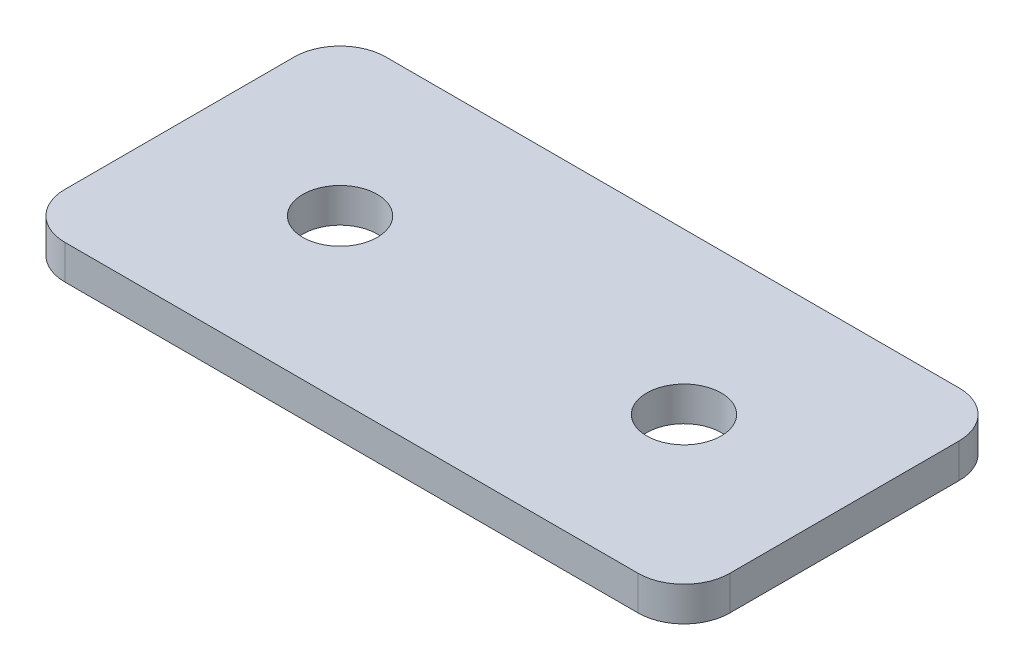
ISO-10303-21;
HEADER;
FILE_DESCRIPTION(('STEP AP214'),'2;1');
FILE_NAME('part.step','',(''),(''),'','','');
FILE_SCHEMA(('AUTOMOTIVE_DESIGN { 1 0 10303 214 1 1 1 1 }'));
ENDSEC;
DATA;
#1=APPLICATION_CONTEXT('core data for automotive mechanical design processes');
#2=APPLICATION_PROTOCOL_DEFINITION('international standard','automotive_design',2000,#1);
#3=PRODUCT_CONTEXT('',#1,'mechanical');
#4=PRODUCT('Part','Part','',(#3));
#5=PRODUCT_RELATED_PRODUCT_CATEGORY('part','',(#4));
#6=PRODUCT_DEFINITION_FORMATION('','',#4);
#7=PRODUCT_DEFINITION_CONTEXT('part definition',#1,'design');
#8=PRODUCT_DEFINITION('design','',#6,#7);
#9=PRODUCT_DEFINITION_SHAPE('','',#8);
#10=(LENGTH_UNIT() NAMED_UNIT(*) SI_UNIT(.MILLI.,.METRE.));
#11=(NAMED_UNIT(*) PLANE_ANGLE_UNIT() SI_UNIT($,.RADIAN.));
#12=(NAMED_UNIT(*) SI_UNIT($,.STERADIAN.) SOLID_ANGLE_UNIT());
#13=UNCERTAINTY_MEASURE_WITH_UNIT(LENGTH_MEASURE(1.E-05),#10,'distance_accuracy_value','');
#14=(GEOMETRIC_REPRESENTATION_CONTEXT(3) GLOBAL_UNCERTAINTY_ASSIGNED_CONTEXT((#13)) GLOBAL_UNIT_ASSIGNED_CONTEXT((#10,
#11,#12)) REPRESENTATION_CONTEXT('',''));
#15=CARTESIAN_POINT('',(0.,0.,0.));
#16=DIRECTION('',(0.,0.,1.));
#17=DIRECTION('',(1.,0.,0.));
#18=AXIS2_PLACEMENT_3D('',#15,#16,#17);
#19=CARTESIAN_POINT('',(-8.92451364331455,1.52470932668439,-0.849826009471142));
#20=DIRECTION('',(0.,-1.,0.));
#21=DIRECTION('',(0.,0.,-1.));
#22=AXIS2_PLACEMENT_3D('',#19,#20,#21);
#23=PLANE('',#22);
#24=CARTESIAN_POINT('',(6.07548635668547,1.52470932668439,-0.849826009471132));
#25=DIRECTION('',(0.,1.,0.));
#26=DIRECTION('',(0.,0.,1.));
#27=AXIS2_PLACEMENT_3D('',#24,#25,#26);
#28=CIRCLE('',#27,1.625);
#29=CARTESIAN_POINT('',(6.07548635668547,1.52470932668439,0.775173990528869));
#30=VERTEX_POINT('',#29);
#31=EDGE_CURVE('E157',#30,#30,#28,.T.);
#32=ORIENTED_EDGE('',*,*,#31,.T.);
#33=EDGE_LOOP('',(#32));
#34=FACE_BOUND('',#33,.T.);
#35=CARTESIAN_POINT('',(-8.92451364331455,1.52470932668439,-0.849826009471142));
#36=DIRECTION('',(0.,1.,0.));
#37=DIRECTION('',(0.,0.,1.));
#38=AXIS2_PLACEMENT_3D('',#35,#36,#37);
#39=CIRCLE('',#38,1.625);
#40=CARTESIAN_POINT('',(-8.92451364331455,1.52470932668439,0.775173990528858));
#41=VERTEX_POINT('',#40);
#42=EDGE_CURVE('E103',#41,#41,#39,.T.);
#43=ORIENTED_EDGE('',*,*,#42,.T.);
#44=EDGE_LOOP('',(#43));
#45=FACE_BOUND('',#44,.T.);
#46=DIRECTION('',(0.,0.,-1.));
#47=VECTOR('',#46,1.);
#48=CARTESIAN_POINT('',(13.0754863566854,1.52470932668439,6.1501739905289));
#49=LINE('',#48,#47);
#50=CARTESIAN_POINT('',(13.0754863566854,1.52470932668439,4.1501739905289));
#51=VERTEX_POINT('',#50);
#52=CARTESIAN_POINT('',(13.0754863566854,1.52470932668439,-5.84982600947118));
#53=VERTEX_POINT('',#52);
#54=EDGE_CURVE('E150',#51,#53,#49,.T.);
#55=ORIENTED_EDGE('',*,*,#54,.F.);
#56=CARTESIAN_POINT('',(11.0754863566854,1.52470932668439,4.1501739905289));
#57=DIRECTION('',(0.,-1.,0.));
#58=DIRECTION('',(0.,0.,-1.));
#59=AXIS2_PLACEMENT_3D('',#56,#57,#58);
#60=CIRCLE('',#59,2.);
#61=CARTESIAN_POINT('',(11.0754863566854,1.52470932668439,6.1501739905289));
#62=VERTEX_POINT('',#61);
#63=EDGE_CURVE('E130',#51,#62,#60,.T.);
#64=ORIENTED_EDGE('',*,*,#63,.T.);
#65=DIRECTION('',(1.,0.,0.));
#66=VECTOR('',#65,1.);
#67=CARTESIAN_POINT('',(-1.92451364331445,1.52470932668439,6.15017399052889));
#68=LINE('',#67,#66);
#69=CARTESIAN_POINT('',(-13.9245136433146,1.52470932668439,6.15017399052889));
#70=VERTEX_POINT('',#69);
#71=EDGE_CURVE('E146',#70,#62,#68,.T.);
#72=ORIENTED_EDGE('',*,*,#71,.F.);
#73=CARTESIAN_POINT('',(-13.9245136433146,1.52470932668439,4.15017399052889));
#74=DIRECTION('',(0.,-1.,0.));
#75=DIRECTION('',(0.,0.,-1.));
#76=AXIS2_PLACEMENT_3D('',#73,#74,#75);
#77=CIRCLE('',#76,2.);
#78=CARTESIAN_POINT('',(-15.9245136433146,1.52470932668439,4.15017399052889));
#79=VERTEX_POINT('',#78);
#80=EDGE_CURVE('E106',#70,#79,#77,.T.);
#81=ORIENTED_EDGE('',*,*,#80,.T.);
#82=DIRECTION('',(0.,0.,1.));
#83=VECTOR('',#82,1.);
#84=CARTESIAN_POINT('',(-15.9245136433146,1.52470932668439,-7.84982600947118));
#85=LINE('',#84,#83);
#86=CARTESIAN_POINT('',(-15.9245136433146,1.52470932668439,-5.84982600947118));
#87=VERTEX_POINT('',#86);
#88=EDGE_CURVE('E107',#87,#79,#85,.T.);
#89=ORIENTED_EDGE('',*,*,#88,.F.);
#90=CARTESIAN_POINT('',(-13.9245136433146,1.52470932668439,-5.84982600947118));
#91=DIRECTION('',(0.,-1.,0.));
#92=DIRECTION('',(0.,0.,-1.));
#93=AXIS2_PLACEMENT_3D('',#90,#91,#92);
#94=CIRCLE('',#93,2.);
#95=CARTESIAN_POINT('',(-13.9245136433146,1.52470932668439,-7.84982600947118));
#96=VERTEX_POINT('',#95);
#97=EDGE_CURVE('E31',#87,#96,#94,.T.);
#98=ORIENTED_EDGE('',*,*,#97,.T.);
#99=DIRECTION('',(-1.,0.,0.));
#100=VECTOR('',#99,1.);
#101=CARTESIAN_POINT('',(13.0754863566854,1.52470932668439,-7.84982600947118));
#102=LINE('',#101,#100);
#103=CARTESIAN_POINT('',(11.0754863566854,1.52470932668439,-7.84982600947118));
#104=VERTEX_POINT('',#103);
#105=EDGE_CURVE('E111',#104,#96,#102,.T.);
#106=ORIENTED_EDGE('',*,*,#105,.F.);
#107=CARTESIAN_POINT('',(11.0754863566854,1.52470932668439,-5.84982600947118));
#108=DIRECTION('',(0.,-1.,0.));
#109=DIRECTION('',(0.,0.,-1.));
#110=AXIS2_PLACEMENT_3D('',#107,#108,#109);
#111=CIRCLE('',#110,2.);
#112=EDGE_CURVE('E128',#104,#53,#111,.T.);
#113=ORIENTED_EDGE('',*,*,#112,.T.);
#114=EDGE_LOOP('',(#55,#64,#72,#81,#89,#98,#106,#113));
#115=FACE_BOUND('',#114,.T.);
#116=ADVANCED_FACE('F16',(#34,#45,#115),#23,.T.);
#117=CARTESIAN_POINT('',(-1.92451364331445,1.52470932668439,6.15017399052889));
#118=DIRECTION('',(0.,0.,1.));
#119=DIRECTION('',(1.,0.,0.));
#120=AXIS2_PLACEMENT_3D('',#117,#118,#119);
#121=PLANE('',#120);
#122=ORIENTED_EDGE('',*,*,#71,.T.);
#123=DIRECTION('',(0.,1.,0.));
#124=VECTOR('',#123,1.);
#125=CARTESIAN_POINT('',(11.0754863566854,1.52470932668439,6.1501739905289));
#126=LINE('',#125,#124);
#127=CARTESIAN_POINT('',(11.0754863566854,3.02470932668439,6.1501739905289));
#128=VERTEX_POINT('',#127);
#129=EDGE_CURVE('E93',#62,#128,#126,.T.);
#130=ORIENTED_EDGE('',*,*,#129,.T.);
#131=DIRECTION('',(1.,0.,0.));
#132=VECTOR('',#131,1.);
#133=CARTESIAN_POINT('',(-1.92451364331445,3.02470932668439,6.15017399052889));
#134=LINE('',#133,#132);
#135=CARTESIAN_POINT('',(-13.9245136433146,3.02470932668439,6.15017399052889));
#136=VERTEX_POINT('',#135);
#137=EDGE_CURVE('E85',#136,#128,#134,.T.);
#138=ORIENTED_EDGE('',*,*,#137,.F.);
#139=DIRECTION('',(0.,1.,0.));
#140=VECTOR('',#139,1.);
#141=CARTESIAN_POINT('',(-13.9245136433146,1.52470932668439,6.15017399052889));
#142=LINE('',#141,#140);
#143=EDGE_CURVE('E99',#136,#70,#142,.F.);
#144=ORIENTED_EDGE('',*,*,#143,.T.);
#145=EDGE_LOOP('',(#122,#130,#138,#144));
#146=FACE_BOUND('',#145,.T.);
#147=ADVANCED_FACE('F98',(#146),#121,.T.);
#148=CARTESIAN_POINT('',(-15.9245136433146,1.52470932668439,-7.84982600947118));
#149=DIRECTION('',(-1.,0.,0.));
#150=DIRECTION('',(0.,0.,1.));
#151=AXIS2_PLACEMENT_3D('',#148,#149,#150);
#152=PLANE('',#151);
#153=DIRECTION('',(0.,0.,1.));
#154=VECTOR('',#153,1.);
#155=CARTESIAN_POINT('',(-15.9245136433146,3.02470932668439,-7.84982600947118));
#156=LINE('',#155,#154);
#157=CARTESIAN_POINT('',(-15.9245136433146,3.02470932668439,-5.84982600947118));
#158=VERTEX_POINT('',#157);
#159=CARTESIAN_POINT('',(-15.9245136433146,3.02470932668439,4.15017399052889));
#160=VERTEX_POINT('',#159);
#161=EDGE_CURVE('E87',#158,#160,#156,.T.);
#162=ORIENTED_EDGE('',*,*,#161,.F.);
#163=DIRECTION('',(0.,1.,0.));
#164=VECTOR('',#163,1.);
#165=CARTESIAN_POINT('',(-15.9245136433146,1.52470932668439,-5.84982600947118));
#166=LINE('',#165,#164);
#167=EDGE_CURVE('E10',#158,#87,#166,.F.);
#168=ORIENTED_EDGE('',*,*,#167,.T.);
#169=ORIENTED_EDGE('',*,*,#88,.T.);
#170=DIRECTION('',(0.,1.,0.));
#171=VECTOR('',#170,1.);
#172=CARTESIAN_POINT('',(-15.9245136433146,1.52470932668439,4.15017399052889));
#173=LINE('',#172,#171);
#174=EDGE_CURVE('E24',#79,#160,#173,.T.);
#175=ORIENTED_EDGE('',*,*,#174,.T.);
#176=EDGE_LOOP('',(#162,#168,#169,#175));
#177=FACE_BOUND('',#176,.T.);
#178=ADVANCED_FACE('F136',(#177),#152,.T.);
#179=CARTESIAN_POINT('',(13.0754863566854,1.52470932668439,-7.84982600947118));
#180=DIRECTION('',(0.,0.,-1.));
#181=DIRECTION('',(-1.,0.,0.));
#182=AXIS2_PLACEMENT_3D('',#179,#180,#181);
#183=PLANE('',#182);
#184=DIRECTION('',(-1.,0.,0.));
#185=VECTOR('',#184,1.);
#186=CARTESIAN_POINT('',(13.0754863566854,3.02470932668439,-7.84982600947118));
#187=LINE('',#186,#185);
#188=CARTESIAN_POINT('',(11.0754863566854,3.02470932668439,-7.84982600947118));
#189=VERTEX_POINT('',#188);
#190=CARTESIAN_POINT('',(-13.9245136433146,3.02470932668439,-7.84982600947118));
#191=VERTEX_POINT('',#190);
#192=EDGE_CURVE('E144',#189,#191,#187,.T.);
#193=ORIENTED_EDGE('',*,*,#192,.F.);
#194=DIRECTION('',(0.,1.,0.));
#195=VECTOR('',#194,1.);
#196=CARTESIAN_POINT('',(11.0754863566854,1.52470932668439,-7.84982600947118));
#197=LINE('',#196,#195);
#198=EDGE_CURVE('E38',#189,#104,#197,.F.);
#199=ORIENTED_EDGE('',*,*,#198,.T.);
#200=ORIENTED_EDGE('',*,*,#105,.T.);
#201=DIRECTION('',(0.,1.,0.));
#202=VECTOR('',#201,1.);
#203=CARTESIAN_POINT('',(-13.9245136433146,1.52470932668439,-7.84982600947118));
#204=LINE('',#203,#202);
#205=EDGE_CURVE('E132',#96,#191,#204,.T.);
#206=ORIENTED_EDGE('',*,*,#205,.T.);
#207=EDGE_LOOP('',(#193,#199,#200,#206));
#208=FACE_BOUND('',#207,.T.);
#209=ADVANCED_FACE('F143',(#208),#183,.T.);
#210=CARTESIAN_POINT('',(13.0754863566854,1.52470932668439,6.1501739905289));
#211=DIRECTION('',(1.,0.,0.));
#212=DIRECTION('',(0.,0.,-1.));
#213=AXIS2_PLACEMENT_3D('',#210,#211,#212);
#214=PLANE('',#213);
#215=DIRECTION('',(0.,0.,-1.));
#216=VECTOR('',#215,1.);
#217=CARTESIAN_POINT('',(13.0754863566854,3.02470932668439,6.1501739905289));
#218=LINE('',#217,#216);
#219=CARTESIAN_POINT('',(13.0754863566854,3.02470932668439,4.1501739905289));
#220=VERTEX_POINT('',#219);
#221=CARTESIAN_POINT('',(13.0754863566854,3.02470932668439,-5.84982600947118));
#222=VERTEX_POINT('',#221);
#223=EDGE_CURVE('E102',#220,#222,#218,.T.);
#224=ORIENTED_EDGE('',*,*,#223,.F.);
#225=DIRECTION('',(0.,1.,0.));
#226=VECTOR('',#225,1.);
#227=CARTESIAN_POINT('',(13.0754863566854,1.52470932668439,4.1501739905289));
#228=LINE('',#227,#226);
#229=EDGE_CURVE('E124',#220,#51,#228,.F.);
#230=ORIENTED_EDGE('',*,*,#229,.T.);
#231=ORIENTED_EDGE('',*,*,#54,.T.);
#232=DIRECTION('',(0.,1.,0.));
#233=VECTOR('',#232,1.);
#234=CARTESIAN_POINT('',(13.0754863566854,1.52470932668439,-5.84982600947118));
#235=LINE('',#234,#233);
#236=EDGE_CURVE('E121',#53,#222,#235,.T.);
#237=ORIENTED_EDGE('',*,*,#236,.T.);
#238=EDGE_LOOP('',(#224,#230,#231,#237));
#239=FACE_BOUND('',#238,.T.);
#240=ADVANCED_FACE('F178',(#239),#214,.T.);
#241=CARTESIAN_POINT('',(-8.92451364331455,3.02470932668439,-0.849826009471142));
#242=DIRECTION('',(0.,-1.,0.));
#243=DIRECTION('',(0.,0.,-1.));
#244=AXIS2_PLACEMENT_3D('',#241,#242,#243);
#245=PLANE('',#244);
#246=CARTESIAN_POINT('',(6.07548635668547,3.02470932668439,-0.849826009471132));
#247=DIRECTION('',(0.,1.,0.));
#248=DIRECTION('',(0.,0.,1.));
#249=AXIS2_PLACEMENT_3D('',#246,#247,#248);
#250=CIRCLE('',#249,1.625);
#251=CARTESIAN_POINT('',(6.07548635668547,3.02470932668439,0.775173990528869));
#252=VERTEX_POINT('',#251);
#253=EDGE_CURVE('E160',#252,#252,#250,.T.);
#254=ORIENTED_EDGE('',*,*,#253,.F.);
#255=EDGE_LOOP('',(#254));
#256=FACE_BOUND('',#255,.T.);
#257=CARTESIAN_POINT('',(-8.92451364331455,3.02470932668439,-0.849826009471142));
#258=DIRECTION('',(0.,1.,0.));
#259=DIRECTION('',(0.,0.,1.));
#260=AXIS2_PLACEMENT_3D('',#257,#258,#259);
#261=CIRCLE('',#260,1.625);
#262=CARTESIAN_POINT('',(-8.92451364331455,3.02470932668439,0.775173990528858));
#263=VERTEX_POINT('',#262);
#264=EDGE_CURVE('E154',#263,#263,#261,.T.);
#265=ORIENTED_EDGE('',*,*,#264,.F.);
#266=EDGE_LOOP('',(#265));
#267=FACE_BOUND('',#266,.T.);
#268=ORIENTED_EDGE('',*,*,#137,.T.);
#269=CARTESIAN_POINT('',(11.0754863566854,3.02470932668439,4.1501739905289));
#270=DIRECTION('',(0.,-1.,0.));
#271=DIRECTION('',(0.,0.,-1.));
#272=AXIS2_PLACEMENT_3D('',#269,#270,#271);
#273=CIRCLE('',#272,2.);
#274=EDGE_CURVE('E119',#128,#220,#273,.F.);
#275=ORIENTED_EDGE('',*,*,#274,.T.);
#276=ORIENTED_EDGE('',*,*,#223,.T.);
#277=CARTESIAN_POINT('',(11.0754863566854,3.02470932668439,-5.84982600947118));
#278=DIRECTION('',(0.,-1.,0.));
#279=DIRECTION('',(0.,0.,-1.));
#280=AXIS2_PLACEMENT_3D('',#277,#278,#279);
#281=CIRCLE('',#280,2.);
#282=EDGE_CURVE('E117',#222,#189,#281,.F.);
#283=ORIENTED_EDGE('',*,*,#282,.T.);
#284=ORIENTED_EDGE('',*,*,#192,.T.);
#285=CARTESIAN_POINT('',(-13.9245136433146,3.02470932668439,-5.84982600947118));
#286=DIRECTION('',(0.,-1.,0.));
#287=DIRECTION('',(0.,0.,-1.));
#288=AXIS2_PLACEMENT_3D('',#285,#286,#287);
#289=CIRCLE('',#288,2.);
#290=EDGE_CURVE('E92',#191,#158,#289,.F.);
#291=ORIENTED_EDGE('',*,*,#290,.T.);
#292=ORIENTED_EDGE('',*,*,#161,.T.);
#293=CARTESIAN_POINT('',(-13.9245136433146,3.02470932668439,4.15017399052889));
#294=DIRECTION('',(0.,-1.,0.));
#295=DIRECTION('',(0.,0.,-1.));
#296=AXIS2_PLACEMENT_3D('',#293,#294,#295);
#297=CIRCLE('',#296,2.);
#298=EDGE_CURVE('E82',#160,#136,#297,.F.);
#299=ORIENTED_EDGE('',*,*,#298,.T.);
#300=EDGE_LOOP('',(#268,#275,#276,#283,#284,#291,#292,#299));
#301=FACE_BOUND('',#300,.T.);
#302=ADVANCED_FACE('F84',(#256,#267,#301),#245,.F.);
#303=CARTESIAN_POINT('',(-8.92451364331455,1.52470932668439,-0.849826009471142));
#304=DIRECTION('',(0.,1.,0.));
#305=DIRECTION('',(0.,0.,1.));
#306=AXIS2_PLACEMENT_3D('',#303,#304,#305);
#307=CYLINDRICAL_SURFACE('',#306,1.625);
#308=ORIENTED_EDGE('',*,*,#42,.F.);
#309=EDGE_LOOP('',(#308));
#310=FACE_BOUND('',#309,.T.);
#311=ORIENTED_EDGE('',*,*,#264,.T.);
#312=EDGE_LOOP('',(#311));
#313=FACE_BOUND('',#312,.T.);
#314=ADVANCED_FACE('F172',(#310,#313),#307,.F.);
#315=CARTESIAN_POINT('',(6.07548635668547,1.52470932668439,-0.849826009471132));
#316=DIRECTION('',(0.,1.,0.));
#317=DIRECTION('',(0.,0.,1.));
#318=AXIS2_PLACEMENT_3D('',#315,#316,#317);
#319=CYLINDRICAL_SURFACE('',#318,1.625);
#320=ORIENTED_EDGE('',*,*,#31,.F.);
#321=EDGE_LOOP('',(#320));
#322=FACE_BOUND('',#321,.T.);
#323=ORIENTED_EDGE('',*,*,#253,.T.);
#324=EDGE_LOOP('',(#323));
#325=FACE_BOUND('',#324,.T.);
#326=ADVANCED_FACE('F168',(#322,#325),#319,.F.);
#327=CARTESIAN_POINT('',(11.0754863566854,1.52470932668439,4.1501739905289));
#328=DIRECTION('',(0.,1.,0.));
#329=DIRECTION('',(0.,0.,1.));
#330=AXIS2_PLACEMENT_3D('',#327,#328,#329);
#331=CYLINDRICAL_SURFACE('',#330,2.);
#332=ORIENTED_EDGE('',*,*,#63,.F.);
#333=ORIENTED_EDGE('',*,*,#229,.F.);
#334=ORIENTED_EDGE('',*,*,#274,.F.);
#335=ORIENTED_EDGE('',*,*,#129,.F.);
#336=EDGE_LOOP('',(#332,#333,#334,#335));
#337=FACE_BOUND('',#336,.T.);
#338=ADVANCED_FACE('F171',(#337),#331,.T.);
#339=CARTESIAN_POINT('',(11.0754863566854,1.52470932668439,-5.84982600947118));
#340=DIRECTION('',(0.,1.,0.));
#341=DIRECTION('',(0.,0.,1.));
#342=AXIS2_PLACEMENT_3D('',#339,#340,#341);
#343=CYLINDRICAL_SURFACE('',#342,2.);
#344=ORIENTED_EDGE('',*,*,#112,.F.);
#345=ORIENTED_EDGE('',*,*,#198,.F.);
#346=ORIENTED_EDGE('',*,*,#282,.F.);
#347=ORIENTED_EDGE('',*,*,#236,.F.);
#348=EDGE_LOOP('',(#344,#345,#346,#347));
#349=FACE_BOUND('',#348,.T.);
#350=ADVANCED_FACE('F199',(#349),#343,.T.);
#351=CARTESIAN_POINT('',(-13.9245136433146,1.52470932668439,-5.84982600947118));
#352=DIRECTION('',(0.,1.,0.));
#353=DIRECTION('',(0.,0.,1.));
#354=AXIS2_PLACEMENT_3D('',#351,#352,#353);
#355=CYLINDRICAL_SURFACE('',#354,2.);
#356=ORIENTED_EDGE('',*,*,#97,.F.);
#357=ORIENTED_EDGE('',*,*,#167,.F.);
#358=ORIENTED_EDGE('',*,*,#290,.F.);
#359=ORIENTED_EDGE('',*,*,#205,.F.);
#360=EDGE_LOOP('',(#356,#357,#358,#359));
#361=FACE_BOUND('',#360,.T.);
#362=ADVANCED_FACE('F141',(#361),#355,.T.);
#363=CARTESIAN_POINT('',(-13.9245136433146,1.52470932668439,4.15017399052889));
#364=DIRECTION('',(0.,1.,0.));
#365=DIRECTION('',(0.,0.,1.));
#366=AXIS2_PLACEMENT_3D('',#363,#364,#365);
#367=CYLINDRICAL_SURFACE('',#366,2.);
#368=ORIENTED_EDGE('',*,*,#80,.F.);
#369=ORIENTED_EDGE('',*,*,#143,.F.);
#370=ORIENTED_EDGE('',*,*,#298,.F.);
#371=ORIENTED_EDGE('',*,*,#174,.F.);
#372=EDGE_LOOP('',(#368,#369,#370,#371));
#373=FACE_BOUND('',#372,.T.);
#374=ADVANCED_FACE('F18',(#373),#367,.T.);
#375=CLOSED_SHELL('',(#116,#147,#178,#209,#240,#302,#314,#326,#338,#350,#362,#374));
#376=MANIFOLD_SOLID_BREP('B1',#375);
#377=ADVANCED_BREP_SHAPE_REPRESENTATION('',(#18,#376),#14);
#378=SHAPE_DEFINITION_REPRESENTATION(#9,#377);
ENDSEC;
END-ISO-10303-21;
